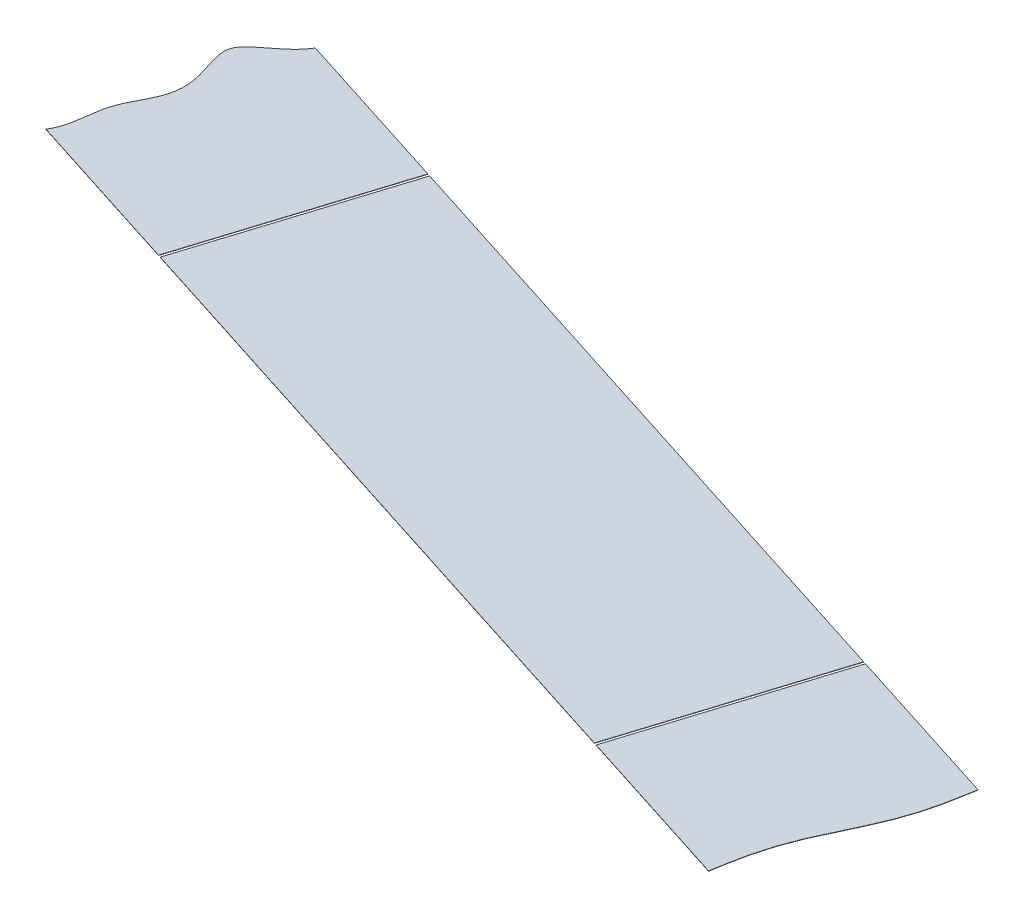
ISO-10303-21;
HEADER;
FILE_DESCRIPTION(('STEP AP214'),'2;1');
FILE_NAME('part.step','',(''),(''),'','','');
FILE_SCHEMA(('AUTOMOTIVE_DESIGN { 1 0 10303 214 1 1 1 1 }'));
ENDSEC;
DATA;
#1=APPLICATION_CONTEXT('core data for automotive mechanical design processes');
#2=APPLICATION_PROTOCOL_DEFINITION('international standard','automotive_design',2000,#1);
#3=PRODUCT_CONTEXT('',#1,'mechanical');
#4=PRODUCT('Part','Part','',(#3));
#5=PRODUCT_RELATED_PRODUCT_CATEGORY('part','',(#4));
#6=PRODUCT_DEFINITION_FORMATION('','',#4);
#7=PRODUCT_DEFINITION_CONTEXT('part definition',#1,'design');
#8=PRODUCT_DEFINITION('design','',#6,#7);
#9=PRODUCT_DEFINITION_SHAPE('','',#8);
#10=(LENGTH_UNIT() NAMED_UNIT(*) SI_UNIT(.MILLI.,.METRE.));
#11=(NAMED_UNIT(*) PLANE_ANGLE_UNIT() SI_UNIT($,.RADIAN.));
#12=(NAMED_UNIT(*) SI_UNIT($,.STERADIAN.) SOLID_ANGLE_UNIT());
#13=UNCERTAINTY_MEASURE_WITH_UNIT(LENGTH_MEASURE(1.E-05),#10,'distance_accuracy_value','');
#14=(GEOMETRIC_REPRESENTATION_CONTEXT(3) GLOBAL_UNCERTAINTY_ASSIGNED_CONTEXT((#13)) GLOBAL_UNIT_ASSIGNED_CONTEXT((#10,
#11,#12)) REPRESENTATION_CONTEXT('',''));
#15=CARTESIAN_POINT('',(0.,0.,0.));
#16=DIRECTION('',(0.,0.,1.));
#17=DIRECTION('',(1.,0.,0.));
#18=AXIS2_PLACEMENT_3D('',#15,#16,#17);
#19=CARTESIAN_POINT('',(719.398655825962,60.3000999940948,202.444842964867));
#20=DIRECTION('',(-0.304317580977551,-0.00396825396825266,0.952562366917996));
#21=DIRECTION('',(0.952569867025211,0.,0.304319977056342));
#22=AXIS2_PLACEMENT_3D('',#19,#20,#21);
#23=PLANE('',#22);
#24=DIRECTION('',(-0.00120761895654779,0.999992126449226,0.00378003915478373));
#25=VECTOR('',#24,1.);
#26=CARTESIAN_POINT('',(1017.8293076594,50.4001779422475,297.744018959244));
#27=LINE('',#26,#25);
#28=CARTESIAN_POINT('',(1017.81735223173,60.3000999940948,297.781441346876));
#29=VERTEX_POINT('',#28);
#30=CARTESIAN_POINT('',(1017.81723146984,60.4000992067398,297.781819350792));
#31=VERTEX_POINT('',#30);
#32=EDGE_CURVE('E67',#29,#31,#27,.T.);
#33=ORIENTED_EDGE('',*,*,#32,.T.);
#34=DIRECTION('',(0.952569867025211,0.,0.304319977056342));
#35=VECTOR('',#34,1.);
#36=CARTESIAN_POINT('',(719.398535064066,60.4000992067397,202.445220968783));
#37=LINE('',#36,#35);
#38=CARTESIAN_POINT('',(781.579904447588,60.4000992067397,222.310465040821));
#39=VERTEX_POINT('',#38);
#40=EDGE_CURVE('E102',#39,#31,#37,.T.);
#41=ORIENTED_EDGE('',*,*,#40,.F.);
#42=DIRECTION('',(-0.00120761895654779,0.999992126449226,0.00378003915478373));
#43=VECTOR('',#42,1.);
#44=CARTESIAN_POINT('',(781.59198063715,50.4001779422475,222.272664649272));
#45=LINE('',#44,#43);
#46=CARTESIAN_POINT('',(781.58002520948,60.3000999940948,222.310087036904));
#47=VERTEX_POINT('',#46);
#48=EDGE_CURVE('E117',#47,#39,#45,.T.);
#49=ORIENTED_EDGE('',*,*,#48,.F.);
#50=DIRECTION('',(0.952569867025211,0.,0.304319977056342));
#51=VECTOR('',#50,1.);
#52=CARTESIAN_POINT('',(719.398655825962,60.3000999940948,202.444842964867));
#53=LINE('',#52,#51);
#54=EDGE_CURVE('E55',#47,#29,#53,.T.);
#55=ORIENTED_EDGE('',*,*,#54,.T.);
#56=EDGE_LOOP('',(#33,#41,#49,#55));
#57=FACE_BOUND('',#56,.T.);
#58=ADVANCED_FACE('F52',(#57),#23,.T.);
#59=CARTESIAN_POINT('',(743.532605919061,60.6151075220523,126.821173368969));
#60=DIRECTION('',(-0.304317580977552,-0.00396825396825266,0.952562366917996));
#61=DIRECTION('',(0.95256986702521,0.,0.304319977056343));
#62=AXIS2_PLACEMENT_3D('',#59,#60,#61);
#63=PLANE('',#62);
#64=DIRECTION('',(0.95256986702521,0.,0.304319977056343));
#65=VECTOR('',#64,1.);
#66=CARTESIAN_POINT('',(743.532485157165,60.7151067346972,126.821551372884));
#67=LINE('',#66,#65);
#68=CARTESIAN_POINT('',(805.737211330316,60.7151067346972,146.694257299354));
#69=VERTEX_POINT('',#68);
#70=CARTESIAN_POINT('',(1041.97453835257,60.7151067346972,222.165611609327));
#71=VERTEX_POINT('',#70);
#72=EDGE_CURVE('E100',#69,#71,#67,.T.);
#73=ORIENTED_EDGE('',*,*,#72,.T.);
#74=DIRECTION('',(-0.00120761895654779,0.999992126449226,0.00378003915478373));
#75=VECTOR('',#74,1.);
#76=CARTESIAN_POINT('',(1041.98661454213,50.715185470205,222.127811217778));
#77=LINE('',#76,#75);
#78=CARTESIAN_POINT('',(1041.97465911446,60.6151075220523,222.16523360541));
#79=VERTEX_POINT('',#78);
#80=EDGE_CURVE('E61',#79,#71,#77,.T.);
#81=ORIENTED_EDGE('',*,*,#80,.F.);
#82=DIRECTION('',(0.95256986702521,0.,0.304319977056343));
#83=VECTOR('',#82,1.);
#84=CARTESIAN_POINT('',(743.532605919061,60.6151075220523,126.821173368969));
#85=LINE('',#84,#83);
#86=CARTESIAN_POINT('',(805.737332092211,60.6151075220523,146.693879295439));
#87=VERTEX_POINT('',#86);
#88=EDGE_CURVE('E106',#87,#79,#85,.T.);
#89=ORIENTED_EDGE('',*,*,#88,.F.);
#90=DIRECTION('',(-0.00120761895654779,0.999992126449226,0.00378003915478373));
#91=VECTOR('',#90,1.);
#92=CARTESIAN_POINT('',(805.749287519881,50.715185470205,146.656456907806));
#93=LINE('',#92,#91);
#94=EDGE_CURVE('E105',#87,#69,#93,.T.);
#95=ORIENTED_EDGE('',*,*,#94,.T.);
#96=EDGE_LOOP('',(#73,#81,#89,#95));
#97=FACE_BOUND('',#96,.T.);
#98=ADVANCED_FACE('F104',(#97),#63,.F.);
#99=CARTESIAN_POINT('',(3534.06709107453,45.2776657130148,5075.77080750446));
#100=DIRECTION('',(0.00120761895654779,-0.999992126449226,-0.00378003915478373));
#101=DIRECTION('',(0.,0.0037800419110846,-0.999992855616054));
#102=AXIS2_PLACEMENT_3D('',#99,#100,#101);
#103=PLANE('',#102);
#104=DIRECTION('',(0.304317580977543,0.00396825396817186,-0.952562366917999));
#105=VECTOR('',#104,1.);
#106=CARTESIAN_POINT('',(-134.223544716836,45.2776657130147,3903.85244144675));
#107=LINE('',#106,#105);
#108=EDGE_CURVE('E89',#29,#79,#107,.T.);
#109=ORIENTED_EDGE('',*,*,#108,.F.);
#110=ORIENTED_EDGE('',*,*,#54,.F.);
#111=DIRECTION('',(-0.304317580977547,-0.00396825396817186,0.952562366917998));
#112=VECTOR('',#111,1.);
#113=CARTESIAN_POINT('',(-370.460871739098,45.2776657130147,3828.38108713676));
#114=LINE('',#113,#112);
#115=EDGE_CURVE('E111',#87,#47,#114,.T.);
#116=ORIENTED_EDGE('',*,*,#115,.F.);
#117=ORIENTED_EDGE('',*,*,#88,.T.);
#118=EDGE_LOOP('',(#109,#110,#116,#117));
#119=FACE_BOUND('',#118,.T.);
#120=ADVANCED_FACE('F126',(#119),#103,.T.);
#121=CARTESIAN_POINT('',(3534.06697031264,45.3776649256597,5075.77118550837));
#122=DIRECTION('',(0.00120761895654779,-0.999992126449226,-0.00378003915478373));
#123=DIRECTION('',(0.,0.0037800419110846,-0.999992855616054));
#124=AXIS2_PLACEMENT_3D('',#121,#122,#123);
#125=PLANE('',#124);
#126=ORIENTED_EDGE('',*,*,#40,.T.);
#127=DIRECTION('',(-0.304317580977543,-0.00396825396817186,0.952562366917999));
#128=VECTOR('',#127,1.);
#129=CARTESIAN_POINT('',(1017.81723146984,60.4000992067398,297.781819350792));
#130=LINE('',#129,#128);
#131=EDGE_CURVE('E14',#71,#31,#130,.T.);
#132=ORIENTED_EDGE('',*,*,#131,.F.);
#133=ORIENTED_EDGE('',*,*,#72,.F.);
#134=DIRECTION('',(0.304317580977547,0.00396825396817186,-0.952562366917998));
#135=VECTOR('',#134,1.);
#136=CARTESIAN_POINT('',(781.579904447585,60.4000992067397,222.31046504082));
#137=LINE('',#136,#135);
#138=EDGE_CURVE('E115',#39,#69,#137,.T.);
#139=ORIENTED_EDGE('',*,*,#138,.F.);
#140=EDGE_LOOP('',(#126,#132,#133,#139));
#141=FACE_BOUND('',#140,.T.);
#142=ADVANCED_FACE('F98',(#141),#125,.F.);
#143=CARTESIAN_POINT('',(781.59198063715,50.4001779422475,222.272664649272));
#144=DIRECTION('',(0.952569867025212,0.,0.304319977056338));
#145=DIRECTION('',(0.304319977056338,0.,-0.952569867025212));
#146=AXIS2_PLACEMENT_3D('',#143,#144,#145);
#147=PLANE('',#146);
#148=ORIENTED_EDGE('',*,*,#115,.T.);
#149=ORIENTED_EDGE('',*,*,#48,.T.);
#150=ORIENTED_EDGE('',*,*,#138,.T.);
#151=ORIENTED_EDGE('',*,*,#94,.F.);
#152=EDGE_LOOP('',(#148,#149,#150,#151));
#153=FACE_BOUND('',#152,.T.);
#154=ADVANCED_FACE('F120',(#153),#147,.F.);
#155=CARTESIAN_POINT('',(1017.8293076594,50.4001779422475,297.744018959244));
#156=DIRECTION('',(-0.952569867025213,0.,-0.304319977056334));
#157=DIRECTION('',(-0.304319977056334,0.,0.952569867025213));
#158=AXIS2_PLACEMENT_3D('',#155,#156,#157);
#159=PLANE('',#158);
#160=ORIENTED_EDGE('',*,*,#108,.T.);
#161=ORIENTED_EDGE('',*,*,#80,.T.);
#162=ORIENTED_EDGE('',*,*,#131,.T.);
#163=ORIENTED_EDGE('',*,*,#32,.F.);
#164=EDGE_LOOP('',(#160,#161,#162,#163));
#165=FACE_BOUND('',#164,.T.);
#166=ADVANCED_FACE('F88',(#165),#159,.F.);
#167=CLOSED_SHELL('',(#58,#98,#120,#142,#154,#166));
#168=MANIFOLD_SOLID_BREP('B2',#167);
#169=CARTESIAN_POINT('',(1104.17938528761,60.6151075220523,242.037939531882));
#170=CARTESIAN_POINT('',(1104.11154771936,60.6135241861804,242.435131574222));
#171=CARTESIAN_POINT('',(1104.07390315354,60.6126465257401,242.655286235224));
#172=CARTESIAN_POINT('',(1104.01557961551,60.6112867474837,242.996376601549));
#173=CARTESIAN_POINT('',(1103.8509705991,60.6074604459044,243.956019170203));
#174=CARTESIAN_POINT('',(1103.75536220091,60.6052635368036,244.506657193769));
#175=CARTESIAN_POINT('',(1103.64138769499,60.6026446075666,245.163071252263));
#176=CARTESIAN_POINT('',(1103.42524179593,60.5977695655939,246.383688688955));
#177=CARTESIAN_POINT('',(1103.20268179566,60.5928744512502,247.607567050267));
#178=CARTESIAN_POINT('',(1102.97269854,60.5879701477239,248.831504841225));
#179=CARTESIAN_POINT('',(1102.73406525112,60.5830608878813,250.053990354404));
#180=CARTESIAN_POINT('',(1102.48554017419,60.5781486637371,251.274099904751));
#181=CARTESIAN_POINT('',(1102.22593554525,60.5732345373678,252.491173066748));
#182=CARTESIAN_POINT('',(1101.95415044629,60.568319130116,253.70469375389));
#183=CARTESIAN_POINT('',(1101.66919065167,60.5634028321969,254.914241108638));
#184=CARTESIAN_POINT('',(1101.37018268743,60.558485903564,256.119467310499));
#185=CARTESIAN_POINT('',(1100.89716012042,60.5510733968325,257.929294423356));
#186=CARTESIAN_POINT('',(1100.20882008833,60.5412623165348,260.304865207316));
#187=CARTESIAN_POINT('',(1099.45567525458,60.531449999889,262.660059702731));
#188=CARTESIAN_POINT('',(1098.63794492631,60.5216389714561,264.994280111085));
#189=CARTESIAN_POINT('',(1097.97310344003,60.5142259644113,266.742958689687));
#190=CARTESIAN_POINT('',(1097.51739285545,60.5093090574694,267.898116958927));
#191=CARTESIAN_POINT('',(1097.0477649255,60.5043927894841,269.048659984524));
#192=CARTESIAN_POINT('',(1096.56513878694,60.4994774251692,270.1948113767));
#193=CARTESIAN_POINT('',(1096.07057421074,60.4945633618901,271.336804582004));
#194=CARTESIAN_POINT('',(1095.56527323999,60.4896512330112,272.474856066598));
#195=CARTESIAN_POINT('',(1095.05059341862,60.4847421265142,273.609111708002));
#196=CARTESIAN_POINT('',(1094.52809164489,60.479838089412,274.739527364635));
#197=CARTESIAN_POINT('',(1093.99966284027,60.4749434987449,275.86555048592));
#198=CARTESIAN_POINT('',(1093.46804184452,60.4700697267661,276.98504630051));
#199=CARTESIAN_POINT('',(1093.17993061473,60.4674477433222,277.58663642265));
#200=CARTESIAN_POINT('',(1092.93936448417,60.4652584485421,278.088950088011));
#201=CARTESIAN_POINT('',(1092.51703470664,60.4614319248842,278.966316683573));
#202=CARTESIAN_POINT('',(1092.36597474371,60.4600647543857,279.27973588656));
#203=CARTESIAN_POINT('',(1092.27534198904,60.4592444812573,279.467780721096));
#204=CARTESIAN_POINT('',(1091.91266880014,60.4559633097882,280.219935526965));
#205=CARTESIAN_POINT('',(1091.82200566052,60.4551427617614,280.408043377433));
#206=CARTESIAN_POINT('',(1091.67098789279,60.4537759733199,280.721374989218));
#207=CARTESIAN_POINT('',(1091.24865724423,60.4499494426555,281.598743160035));
#208=CARTESIAN_POINT('',(1091.0080497895,60.4477597728249,282.101142841345));
#209=CARTESIAN_POINT('',(1090.71998094971,60.4451381763814,282.702644126769));
#210=CARTESIAN_POINT('',(1090.18835985953,60.4402644069711,283.822139231689));
#211=CARTESIAN_POINT('',(1089.65993072333,60.4353698178081,284.948161849148));
#212=CARTESIAN_POINT('',(1089.13742838212,60.4304657811338,286.078577211266));
#213=CARTESIAN_POINT('',(1088.62274784452,60.4255566746672,287.212832615815));
#214=CARTESIAN_POINT('',(1088.11744613526,60.4206445466291,288.350883642063));
#215=CARTESIAN_POINT('',(1087.62288061169,60.4157304830769,289.492876616953));
#216=CARTESIAN_POINT('',(1087.14025347876,60.4108151188606,290.639027665351));
#217=CARTESIAN_POINT('',(1086.67062455728,60.4058988518256,291.789570122808));
#218=CARTESIAN_POINT('',(1086.2149128123,60.4009819447856,292.944728047291));
#219=CARTESIAN_POINT('',(1085.55006933554,60.3935689357572,294.693406514722));
#220=CARTESIAN_POINT('',(1084.73233650805,60.3837579078477,297.02762598619));
#221=CARTESIAN_POINT('',(1084.35195987085,60.3788022035299,298.217115056814));
#222=CARTESIAN_POINT('',(1083.97236511369,60.3738523494265,299.405306269121));
#223=CARTESIAN_POINT('',(1083.28545563557,60.364053633696,301.778063086));
#224=CARTESIAN_POINT('',(1082.81336441087,60.3566503406514,303.585750298328));
#225=CARTESIAN_POINT('',(1082.51493407597,60.3517396338226,304.789515087033));
#226=CARTESIAN_POINT('',(1082.23050559307,60.3468295567687,305.9975864798));
#227=CARTESIAN_POINT('',(1081.95920723674,60.341920369914,307.209617090162));
#228=CARTESIAN_POINT('',(1081.70004722777,60.3370124631633,308.42518692432));
#229=CARTESIAN_POINT('',(1081.45192773402,60.3321064563108,309.643781291205));
#230=CARTESIAN_POINT('',(1081.21366473964,60.3272034101324,310.864741306815));
#231=CARTESIAN_POINT('',(1080.98402073264,60.3223053135912,312.087145448792));
#232=CARTESIAN_POINT('',(1080.76177351098,60.3174163925558,313.309485322835));
#233=CARTESIAN_POINT('',(1080.54591863107,60.3125475164368,314.528564583679));
#234=CARTESIAN_POINT('',(1080.43207564678,60.309931512138,315.184246880645));
#235=CARTESIAN_POINT('',(1080.33660816354,60.3077377595052,315.734094893506));
#236=CARTESIAN_POINT('',(1080.17220879469,60.303916295529,316.692524672941));
#237=CARTESIAN_POINT('',(1080.11394356515,60.3025578736056,317.033274855502));
#238=CARTESIAN_POINT('',(1080.07635508698,60.3016815188188,317.253102030309));
#239=CARTESIAN_POINT('',(1080.00859511661,60.3000999940948,317.649839732116));
#240=B_SPLINE_CURVE_WITH_KNOTS('',2,(#169,#170,#171,#172,#173,#174,#175,#176,#177,#178,#179,
#180,#181,#182,#183,#184,#185,#186,#187,#188,#189,#190,#191,#192,#193,#194,#195,#196,#197,#198,
#199,#200,#201,#202,#203,#204,#205,#206,#207,#208,#209,#210,#211,#212,#213,#214,#215,#216,#217,
#218,#219,#220,#221,#222,#223,#224,#225,#226,#227,#228,#229,#230,#231,#232,#233,#234,#235,#236,
#237,#238,#239),.UNSPECIFIED.,.F.,.F.,(3,2,1,2,1,1,1,1,1,1,1,1,1,1,1,1,1,1,1,1,1,1,1,1,1,1,1,2,
1,2,1,2,1,2,1,1,1,1,1,1,1,1,1,1,1,1,1,1,1,1,1,1,1,1,1,1,1,1,2,1,2,3),(0.,0.0078125,0.015625,
0.03125,0.046875,0.0625,0.078125,0.09375,0.109375,0.125,0.140625,0.15625,0.171875,0.1875,
0.21875,0.25,0.28125,0.3125,0.328125,0.34375,0.359375,0.375,0.390625,0.40625,0.421875,0.4375,
0.453125,0.46875,0.484375,0.4921875,0.5,0.5078125,0.515625,0.53125,0.546875,0.5625,0.578125,
0.59375,0.609375,0.625,0.640625,0.65625,0.671875,0.6875,0.71875,0.75,0.750316619873047,
0.781527042388916,0.812737464904785,0.82834267616272,0.843947887420654,0.859553098678589,
0.875158309936523,0.890763521194458,0.906368732452393,0.921973943710327,0.937579154968262,
0.953184366226196,0.968789577484131,0.984394788742065,0.992197394371033,1.),.UNSPECIFIED.);
#241=DIRECTION('',(-0.00120761895657293,0.999992126449225,0.00378003915486053));
#242=VECTOR('',#241,1.);
#243=SURFACE_OF_LINEAR_EXTRUSION('',#240,#242);
#244=CARTESIAN_POINT('',(1104.17926452572,60.7151067346972,242.038317535797));
#245=CARTESIAN_POINT('',(1104.11142695746,60.7135233988253,242.435509578137));
#246=CARTESIAN_POINT('',(1104.07378239165,60.7126457383851,242.655664239139));
#247=CARTESIAN_POINT('',(1104.01545885362,60.7112859601286,242.996754605464));
#248=CARTESIAN_POINT('',(1103.8508498372,60.7074596585493,243.956397174118));
#249=CARTESIAN_POINT('',(1103.75524143902,60.7052627494486,244.507035197684));
#250=CARTESIAN_POINT('',(1103.6412669331,60.7026438202115,245.163449256178));
#251=CARTESIAN_POINT('',(1103.42512103403,60.6977687782388,246.384066692871));
#252=CARTESIAN_POINT('',(1103.20256103377,60.6928736638951,247.607945054182));
#253=CARTESIAN_POINT('',(1102.97257777811,60.6879693603688,248.83188284514));
#254=CARTESIAN_POINT('',(1102.73394448922,60.6830601005262,250.054368358319));
#255=CARTESIAN_POINT('',(1102.4854194123,60.678147876382,251.274477908666));
#256=CARTESIAN_POINT('',(1102.22581478336,60.6732337500127,252.491551070663));
#257=CARTESIAN_POINT('',(1101.95402968439,60.6683183427609,253.705071757805));
#258=CARTESIAN_POINT('',(1101.66906988978,60.6634020448418,254.914619112554));
#259=CARTESIAN_POINT('',(1101.37006192553,60.6584851162089,256.119845314414));
#260=CARTESIAN_POINT('',(1100.89703935853,60.6510726094774,257.929672427271));
#261=CARTESIAN_POINT('',(1100.20869932644,60.6412615291797,260.305243211231));
#262=CARTESIAN_POINT('',(1099.45555449268,60.6314492125339,262.660437706646));
#263=CARTESIAN_POINT('',(1098.63782416441,60.621638184101,264.994658115));
#264=CARTESIAN_POINT('',(1097.97298267814,60.6142251770562,266.743336693602));
#265=CARTESIAN_POINT('',(1097.51727209355,60.6093082701143,267.898494962843));
#266=CARTESIAN_POINT('',(1097.0476441636,60.6043920021291,269.04903798844));
#267=CARTESIAN_POINT('',(1096.56501802504,60.5994766378141,270.195189380616));
#268=CARTESIAN_POINT('',(1096.07045344885,60.594562574535,271.337182585919));
#269=CARTESIAN_POINT('',(1095.56515247809,60.5896504456561,272.475234070513));
#270=CARTESIAN_POINT('',(1095.05047265672,60.5847413391591,273.609489711918));
#271=CARTESIAN_POINT('',(1094.527970883,60.5798373020569,274.739905368551));
#272=CARTESIAN_POINT('',(1093.99954207838,60.5749427113898,275.865928489835));
#273=CARTESIAN_POINT('',(1093.46792108262,60.570068939411,276.985424304425));
#274=CARTESIAN_POINT('',(1093.17980985283,60.5674469559672,277.587014426565));
#275=CARTESIAN_POINT('',(1092.93924372228,60.565257661187,278.089328091926));
#276=CARTESIAN_POINT('',(1092.51691394475,60.5614311375291,278.966694687489));
#277=CARTESIAN_POINT('',(1092.36585398182,60.5600639670307,279.280113890476));
#278=CARTESIAN_POINT('',(1092.27522122715,60.5592436939022,279.468158725011));
#279=CARTESIAN_POINT('',(1091.91254803825,60.5559625224331,280.220313530881));
#280=CARTESIAN_POINT('',(1091.82188489862,60.5551419744063,280.408421381349));
#281=CARTESIAN_POINT('',(1091.6708671309,60.5537751859648,280.721752993133));
#282=CARTESIAN_POINT('',(1091.24853648233,60.5499486553004,281.59912116395));
#283=CARTESIAN_POINT('',(1091.0079290276,60.5477589854698,282.10152084526));
#284=CARTESIAN_POINT('',(1090.71986018782,60.5451373890263,282.703022130684));
#285=CARTESIAN_POINT('',(1090.18823909764,60.540263619616,283.822517235604));
#286=CARTESIAN_POINT('',(1089.65980996144,60.535369030453,284.948539853064));
#287=CARTESIAN_POINT('',(1089.13730762023,60.5304649937788,286.078955215181));
#288=CARTESIAN_POINT('',(1088.62262708262,60.5255558873122,287.21321061973));
#289=CARTESIAN_POINT('',(1088.11732537337,60.520643759274,288.351261645979));
#290=CARTESIAN_POINT('',(1087.6227598498,60.5157296957218,289.493254620869));
#291=CARTESIAN_POINT('',(1087.14013271686,60.5108143315055,290.639405669267));
#292=CARTESIAN_POINT('',(1086.67050379538,60.5058980644705,291.789948126724));
#293=CARTESIAN_POINT('',(1086.2147920504,60.5009811574305,292.945106051207));
#294=CARTESIAN_POINT('',(1085.54994857365,60.4935681484021,294.693784518637));
#295=CARTESIAN_POINT('',(1084.73221574616,60.4837571204926,297.028003990106));
#296=CARTESIAN_POINT('',(1084.35183910896,60.4788014161748,298.21749306073));
#297=CARTESIAN_POINT('',(1083.97224435179,60.4738515620714,299.405684273036));
#298=CARTESIAN_POINT('',(1083.28533487367,60.4640528463409,301.778441089916));
#299=CARTESIAN_POINT('',(1082.81324364898,60.4566495532964,303.586128302243));
#300=CARTESIAN_POINT('',(1082.51481331407,60.4517388464676,304.789893090949));
#301=CARTESIAN_POINT('',(1082.23038483117,60.4468287694136,305.997964483715));
#302=CARTESIAN_POINT('',(1081.95908647484,60.441919582559,307.209995094078));
#303=CARTESIAN_POINT('',(1081.69992646588,60.4370116758082,308.425564928235));
#304=CARTESIAN_POINT('',(1081.45180697212,60.4321056689557,309.64415929512));
#305=CARTESIAN_POINT('',(1081.21354397775,60.4272026227773,310.865119310731));
#306=CARTESIAN_POINT('',(1080.98389997074,60.4223045262361,312.087523452708));
#307=CARTESIAN_POINT('',(1080.76165274908,60.4174156052007,313.309863326751));
#308=CARTESIAN_POINT('',(1080.54579786917,60.4125467290817,314.528942587595));
#309=CARTESIAN_POINT('',(1080.43195488488,60.409930724783,315.184624884561));
#310=CARTESIAN_POINT('',(1080.33648740165,60.4077369721501,315.734472897421));
#311=CARTESIAN_POINT('',(1080.1720880328,60.4039155081739,316.692902676856));
#312=CARTESIAN_POINT('',(1080.11382280326,60.4025570862505,317.033652859417));
#313=CARTESIAN_POINT('',(1080.07623432509,60.4016807314637,317.253480034224));
#314=CARTESIAN_POINT('',(1080.00847435472,60.4000992067397,317.650217736032));
#315=B_SPLINE_CURVE_WITH_KNOTS('',2,(#244,#245,#246,#247,#248,#249,#250,#251,#252,#253,#254,
#255,#256,#257,#258,#259,#260,#261,#262,#263,#264,#265,#266,#267,#268,#269,#270,#271,#272,#273,
#274,#275,#276,#277,#278,#279,#280,#281,#282,#283,#284,#285,#286,#287,#288,#289,#290,#291,#292,
#293,#294,#295,#296,#297,#298,#299,#300,#301,#302,#303,#304,#305,#306,#307,#308,#309,#310,#311,
#312,#313,#314),.UNSPECIFIED.,.F.,.F.,(3,2,1,2,1,1,1,1,1,1,1,1,1,1,1,1,1,1,1,1,1,1,1,1,1,1,1,2,
1,2,1,2,1,2,1,1,1,1,1,1,1,1,1,1,1,1,1,1,1,1,1,1,1,1,1,1,1,1,2,1,2,3),(0.,0.0078125,0.015625,
0.03125,0.046875,0.0625,0.078125,0.09375,0.109375,0.125,0.140625,0.15625,0.171875,0.1875,
0.21875,0.25,0.28125,0.3125,0.328125,0.34375,0.359375,0.375,0.390625,0.40625,0.421875,0.4375,
0.453125,0.46875,0.484375,0.4921875,0.5,0.5078125,0.515625,0.53125,0.546875,0.5625,0.578125,
0.59375,0.609375,0.625,0.640625,0.65625,0.671875,0.6875,0.71875,0.75,0.750316619873047,
0.781527042388916,0.812737464904785,0.82834267616272,0.843947887420654,0.859553098678589,
0.875158309936523,0.890763521194458,0.906368732452393,0.921973943710327,0.937579154968262,
0.953184366226196,0.968789577484131,0.984394788742065,0.992197394371033,1.),.UNSPECIFIED.);
#316=CARTESIAN_POINT('',(1104.17926452572,60.7151067346972,242.038317535798));
#317=VERTEX_POINT('',#316);
#318=CARTESIAN_POINT('',(1080.00847435472,60.4000992067397,317.650217736032));
#319=VERTEX_POINT('',#318);
#320=EDGE_CURVE('E194',#317,#319,#315,.T.);
#321=ORIENTED_EDGE('',*,*,#320,.T.);
#322=DIRECTION('',(-0.00120761895657293,0.999992126449225,0.00378003915486053));
#323=VECTOR('',#322,1.);
#324=CARTESIAN_POINT('',(1080.00859511661,60.3000999940948,317.649839732116));
#325=LINE('',#324,#323);
#326=CARTESIAN_POINT('',(1080.00859511661,60.3000999940948,317.649839732116));
#327=VERTEX_POINT('',#326);
#328=EDGE_CURVE('E246',#327,#319,#325,.T.);
#329=ORIENTED_EDGE('',*,*,#328,.F.);
#330=CARTESIAN_POINT('',(1104.17938528761,60.6151075220523,242.037939531883));
#331=VERTEX_POINT('',#330);
#332=EDGE_CURVE('E247',#331,#327,#240,.T.);
#333=ORIENTED_EDGE('',*,*,#332,.F.);
#334=DIRECTION('',(-0.00120761895657293,0.999992126449225,0.00378003915486053));
#335=VECTOR('',#334,1.);
#336=CARTESIAN_POINT('',(1104.17938528761,60.6151075220523,242.037939531883));
#337=LINE('',#336,#335);
#338=EDGE_CURVE('E50',#331,#317,#337,.T.);
#339=ORIENTED_EDGE('',*,*,#338,.T.);
#340=EDGE_LOOP('',(#321,#329,#333,#339));
#341=FACE_BOUND('',#340,.T.);
#342=ADVANCED_FACE('F185',(#341),#243,.F.);
#343=CARTESIAN_POINT('',(3534.06697031264,45.3776649256597,5075.77118550837));
#344=DIRECTION('',(0.00120761895654779,-0.999992126449226,-0.00378003915478373));
#345=DIRECTION('',(0.,0.0037800419110846,-0.999992855616054));
#346=AXIS2_PLACEMENT_3D('',#343,#344,#345);
#347=PLANE('',#346);
#348=DIRECTION('',(0.95256986702521,0.,0.304319977056343));
#349=VECTOR('',#348,1.);
#350=CARTESIAN_POINT('',(743.532485157165,60.7151067346972,126.821551372884));
#351=LINE('',#350,#349);
#352=CARTESIAN_POINT('',(1042.92710821959,60.7151067346973,222.469931586382));
#353=VERTEX_POINT('',#352);
#354=EDGE_CURVE('E241',#353,#317,#351,.T.);
#355=ORIENTED_EDGE('',*,*,#354,.F.);
#356=DIRECTION('',(0.304317580977548,0.00396825396817186,-0.952562366917997));
#357=VECTOR('',#356,1.);
#358=CARTESIAN_POINT('',(1042.92710821959,60.7151067346973,222.469931586382));
#359=LINE('',#358,#357);
#360=CARTESIAN_POINT('',(1018.76980133686,60.4000992067397,298.08613932785));
#361=VERTEX_POINT('',#360);
#362=EDGE_CURVE('E233',#361,#353,#359,.T.);
#363=ORIENTED_EDGE('',*,*,#362,.F.);
#364=DIRECTION('',(0.952569867025211,0.,0.304319977056342));
#365=VECTOR('',#364,1.);
#366=CARTESIAN_POINT('',(719.398535064066,60.4000992067397,202.445220968783));
#367=LINE('',#366,#365);
#368=EDGE_CURVE('E189',#361,#319,#367,.T.);
#369=ORIENTED_EDGE('',*,*,#368,.T.);
#370=ORIENTED_EDGE('',*,*,#320,.F.);
#371=EDGE_LOOP('',(#355,#363,#369,#370));
#372=FACE_BOUND('',#371,.T.);
#373=ADVANCED_FACE('F244',(#372),#347,.F.);
#374=CARTESIAN_POINT('',(3534.06709107453,45.2776657130148,5075.77080750446));
#375=DIRECTION('',(0.00120761895654779,-0.999992126449226,-0.00378003915478373));
#376=DIRECTION('',(0.,0.0037800419110846,-0.999992855616054));
#377=AXIS2_PLACEMENT_3D('',#374,#375,#376);
#378=PLANE('',#377);
#379=DIRECTION('',(-0.304317580977548,-0.00396825396817186,0.952562366917998));
#380=VECTOR('',#379,1.);
#381=CARTESIAN_POINT('',(-133.270974849824,45.2776657130148,3904.15676142378));
#382=LINE('',#381,#380);
#383=CARTESIAN_POINT('',(1042.92722898149,60.6151075220523,222.469553582466));
#384=VERTEX_POINT('',#383);
#385=CARTESIAN_POINT('',(1018.76992209876,60.3000999940948,298.085761323932));
#386=VERTEX_POINT('',#385);
#387=EDGE_CURVE('E231',#384,#386,#382,.T.);
#388=ORIENTED_EDGE('',*,*,#387,.F.);
#389=DIRECTION('',(0.95256986702521,0.,0.304319977056343));
#390=VECTOR('',#389,1.);
#391=CARTESIAN_POINT('',(743.532605919061,60.6151075220523,126.821173368969));
#392=LINE('',#391,#390);
#393=EDGE_CURVE('E242',#384,#331,#392,.T.);
#394=ORIENTED_EDGE('',*,*,#393,.T.);
#395=ORIENTED_EDGE('',*,*,#332,.T.);
#396=DIRECTION('',(0.952569867025211,0.,0.304319977056342));
#397=VECTOR('',#396,1.);
#398=CARTESIAN_POINT('',(719.398655825962,60.3000999940948,202.444842964867));
#399=LINE('',#398,#397);
#400=EDGE_CURVE('E223',#386,#327,#399,.T.);
#401=ORIENTED_EDGE('',*,*,#400,.F.);
#402=EDGE_LOOP('',(#388,#394,#395,#401));
#403=FACE_BOUND('',#402,.T.);
#404=ADVANCED_FACE('F266',(#403),#378,.T.);
#405=CARTESIAN_POINT('',(743.532605919061,60.6151075220523,126.821173368969));
#406=DIRECTION('',(-0.304317580977552,-0.00396825396825266,0.952562366917996));
#407=DIRECTION('',(0.95256986702521,0.,0.304319977056343));
#408=AXIS2_PLACEMENT_3D('',#405,#406,#407);
#409=PLANE('',#408);
#410=ORIENTED_EDGE('',*,*,#393,.F.);
#411=DIRECTION('',(-0.00120761895654779,0.999992126449226,0.00378003915478373));
#412=VECTOR('',#411,1.);
#413=CARTESIAN_POINT('',(1042.93918440916,50.715185470205,222.432131194834));
#414=LINE('',#413,#412);
#415=EDGE_CURVE('E228',#384,#353,#414,.T.);
#416=ORIENTED_EDGE('',*,*,#415,.T.);
#417=ORIENTED_EDGE('',*,*,#354,.T.);
#418=ORIENTED_EDGE('',*,*,#338,.F.);
#419=EDGE_LOOP('',(#410,#416,#417,#418));
#420=FACE_BOUND('',#419,.T.);
#421=ADVANCED_FACE('F239',(#420),#409,.F.);
#422=CARTESIAN_POINT('',(719.398655825962,60.3000999940948,202.444842964867));
#423=DIRECTION('',(-0.304317580977551,-0.00396825396825266,0.952562366917996));
#424=DIRECTION('',(0.952569867025211,0.,0.304319977056342));
#425=AXIS2_PLACEMENT_3D('',#422,#423,#424);
#426=PLANE('',#425);
#427=DIRECTION('',(-0.00120761895654779,0.999992126449226,0.00378003915478373));
#428=VECTOR('',#427,1.);
#429=CARTESIAN_POINT('',(1018.78187752643,50.4001779422475,298.0483389363));
#430=LINE('',#429,#428);
#431=EDGE_CURVE('E202',#386,#361,#430,.T.);
#432=ORIENTED_EDGE('',*,*,#431,.F.);
#433=ORIENTED_EDGE('',*,*,#400,.T.);
#434=ORIENTED_EDGE('',*,*,#328,.T.);
#435=ORIENTED_EDGE('',*,*,#368,.F.);
#436=EDGE_LOOP('',(#432,#433,#434,#435));
#437=FACE_BOUND('',#436,.T.);
#438=ADVANCED_FACE('F187',(#437),#426,.T.);
#439=CARTESIAN_POINT('',(1042.93918440916,50.715185470205,222.432131194834));
#440=DIRECTION('',(0.952569867025212,0.,0.304319977056339));
#441=DIRECTION('',(0.304319977056339,0.,-0.952569867025212));
#442=AXIS2_PLACEMENT_3D('',#439,#440,#441);
#443=PLANE('',#442);
#444=ORIENTED_EDGE('',*,*,#387,.T.);
#445=ORIENTED_EDGE('',*,*,#431,.T.);
#446=ORIENTED_EDGE('',*,*,#362,.T.);
#447=ORIENTED_EDGE('',*,*,#415,.F.);
#448=EDGE_LOOP('',(#444,#445,#446,#447));
#449=FACE_BOUND('',#448,.T.);
#450=ADVANCED_FACE('F234',(#449),#443,.F.);
#451=CLOSED_SHELL('',(#342,#373,#404,#421,#438,#450));
#452=MANIFOLD_SOLID_BREP('B8',#451);
#453=CARTESIAN_POINT('',(719.398655825961,60.3000999940948,202.444842964866));
#454=CARTESIAN_POINT('',(720.086938593391,60.3052122522405,201.312305866357));
#455=CARTESIAN_POINT('',(720.872120623064,60.3130304882867,199.494871309643));
#456=CARTESIAN_POINT('',(721.209232543418,60.3170100399614,198.549797079023));
#457=CARTESIAN_POINT('',(721.413047876414,60.3196494090865,197.916677424384));
#458=CARTESIAN_POINT('',(721.682367393787,60.3234827023809,196.988637365931));
#459=CARTESIAN_POINT('',(721.915577629332,60.327498652648,196.000740311669));
#460=CARTESIAN_POINT('',(722.054554720819,60.3301454920289,195.344930392982));
#461=CARTESIAN_POINT('',(722.180332329845,60.3327799842052,194.688169997964));
#462=CARTESIAN_POINT('',(722.292821293786,60.3353603678096,194.04147842091));
#463=CARTESIAN_POINT('',(722.39765003574,60.337964427728,193.386076151831));
#464=CARTESIAN_POINT('',(722.491927217757,60.3404810800053,192.750426241393));
#465=CARTESIAN_POINT('',(722.561961739956,60.3424506281811,192.251765361271));
#466=CARTESIAN_POINT('',(722.609412732941,60.34381370465,191.906328987584));
#467=CARTESIAN_POINT('',(722.657686726547,60.3452253153285,191.548316036176));
#468=CARTESIAN_POINT('',(722.690757894747,60.3462026097151,191.300342593604));
#469=CARTESIAN_POINT('',(722.712679558363,60.3468538590329,191.135060926398));
#470=CARTESIAN_POINT('',(722.737639688308,60.3475979052103,190.946200979763));
#471=CARTESIAN_POINT('',(722.796938902645,60.3493570275705,190.49977765312));
#472=CARTESIAN_POINT('',(722.864759753156,60.3513563715698,189.992527216252));
#473=CARTESIAN_POINT('',(722.928797388112,60.3531914359687,189.527527565046));
#474=CARTESIAN_POINT('',(722.970831227785,60.3543731634578,189.228335605194));
#475=CARTESIAN_POINT('',(723.043974763686,60.356375813902,188.721910915568));
#476=CARTESIAN_POINT('',(723.144406926635,60.358958728818,188.070697873944));
#477=CARTESIAN_POINT('',(723.252643830854,60.3615427703849,187.421680182971));
#478=CARTESIAN_POINT('',(723.371059264864,60.3641443694408,186.771269499754));
#479=CARTESIAN_POINT('',(723.500005802495,60.3667388065703,186.126117870643));
#480=CARTESIAN_POINT('',(723.641755960772,60.3693481587295,185.481110944469));
#481=CARTESIAN_POINT('',(723.798397240745,60.3719816542359,184.834474311272));
#482=CARTESIAN_POINT('',(724.063090285931,60.3760598710301,183.840162826315));
#483=CARTESIAN_POINT('',(724.461016995183,60.3812487832134,182.594586445253));
#484=CARTESIAN_POINT('',(724.907098109876,60.3863425650999,181.389560363906));
#485=CARTESIAN_POINT('',(725.417755262418,60.391545763946,180.176218799701));
#486=CARTESIAN_POINT('',(725.973102520453,60.396725760412,178.983292583841));
#487=CARTESIAN_POINT('',(726.288643383492,60.3994918904975,178.35233214116));
#488=CARTESIAN_POINT('',(726.552822294542,60.4018077656167,177.824075860636));
#489=CARTESIAN_POINT('',(726.892516977714,60.4046788299914,177.173072013957));
#490=CARTESIAN_POINT('',(727.094304690212,60.4063843188945,176.786358345611));
#491=CARTESIAN_POINT('',(727.924256024317,60.4133159865973,175.217763968911));
#492=CARTESIAN_POINT('',(728.132796794922,60.4150802860172,174.817649663496));
#493=CARTESIAN_POINT('',(728.471387191622,60.4179448330253,174.168017167158));
#494=CARTESIAN_POINT('',(728.73438366897,60.4202563390625,173.640538952187));
#495=CARTESIAN_POINT('',(729.050001826531,60.4230303430492,173.007520198316));
#496=CARTESIAN_POINT('',(729.602494792361,60.4282167959623,171.81197409064));
#497=CARTESIAN_POINT('',(730.105673282004,60.4334233234934,170.595362710094));
#498=CARTESIAN_POINT('',(730.781509223776,60.4414175649077,168.696433656057));
#499=CARTESIAN_POINT('',(731.346667271782,60.4517654375638,166.13950363135));
#500=CARTESIAN_POINT('',(731.555187712655,60.4619161077943,163.520806663904));
#501=CARTESIAN_POINT('',(731.418605530389,60.4717159916992,160.884657785707));
#502=CARTESIAN_POINT('',(731.196614876911,60.4766306534627,159.513586488089));
#503=CARTESIAN_POINT('',(730.997215813272,60.4810451589313,158.282046652314));
#504=CARTESIAN_POINT('',(730.50975014291,60.487973918576,156.293342946563));
#505=CARTESIAN_POINT('',(730.160898904768,60.4923353070129,155.028109103829));
#506=CARTESIAN_POINT('',(729.960441196561,60.4946342601899,154.355890774761));
#507=CARTESIAN_POINT('',(729.793225346436,60.4965519784623,153.79514626476));
#508=CARTESIAN_POINT('',(729.574820052275,60.4989344002953,153.095112921204));
#509=CARTESIAN_POINT('',(729.469706702502,60.5000810040917,152.758203278165));
#510=CARTESIAN_POINT('',(729.177268815323,60.5032276099876,151.832357139066));
#511=CARTESIAN_POINT('',(728.921782418416,60.5059766211044,151.023497875137));
#512=CARTESIAN_POINT('',(728.779570735792,60.5075521355306,150.561269979188));
#513=CARTESIAN_POINT('',(728.560387670811,60.5099803894862,149.848863480052));
#514=CARTESIAN_POINT('',(728.401635135722,60.5118988741106,149.290620032443));
#515=CARTESIAN_POINT('',(728.203941153354,60.5142879563718,148.595441399696));
#516=CARTESIAN_POINT('',(728.06292455327,60.5163265553,148.011088405931));
#517=CARTESIAN_POINT('',(727.894161229195,60.5187662732579,147.311756883237));
#518=CARTESIAN_POINT('',(727.790926423102,60.5209263305736,146.707342874899));
#519=CARTESIAN_POINT('',(727.670600990957,60.523443987552,146.002867519162));
#520=CARTESIAN_POINT('',(727.587466841466,60.5283510992083,144.67815441706));
#521=CARTESIAN_POINT('',(727.711013002134,60.5334563924897,143.367041966613));
#522=CARTESIAN_POINT('',(728.089407001019,60.5386571067416,142.112103236245));
#523=CARTESIAN_POINT('',(728.717314028176,60.5437966145796,140.95306896079));
#524=CARTESIAN_POINT('',(729.529472011985,60.5487270974127,139.908194430656));
#525=CARTESIAN_POINT('',(730.454509900635,60.5534224656784,138.961580424812));
#526=CARTESIAN_POINT('',(730.991615066122,60.5558669168883,138.486502387169));
#527=CARTESIAN_POINT('',(731.445162398983,60.5579310830847,138.085332577754));
#528=CARTESIAN_POINT('',(732.008767948681,60.560334926102,137.629463399134));
#529=CARTESIAN_POINT('',(732.46238733536,60.5622696653815,137.262555909804));
#530=CARTESIAN_POINT('',(733.046296511152,60.564674554901,136.812896336114));
#531=CARTESIAN_POINT('',(733.481429178663,60.5664666931908,136.477807288223));
#532=CARTESIAN_POINT('',(734.360104078081,60.5700338677244,135.814840086158));
#533=CARTESIAN_POINT('',(734.93685595742,60.5723756176585,135.379597241797));
#534=CARTESIAN_POINT('',(735.152009505906,60.5732519879151,135.21649315015));
#535=CARTESIAN_POINT('',(735.750871001669,60.5756912895506,134.762506864653));
#536=CARTESIAN_POINT('',(736.20796218318,60.5775841328462,134.407791910224));
#537=CARTESIAN_POINT('',(736.764638012297,60.5798893624231,133.975796611816));
#538=CARTESIAN_POINT('',(737.778138292534,60.5842079566648,133.157117767131));
#539=CARTESIAN_POINT('',(738.254999119128,60.5863224369897,132.750085606976));
#540=CARTESIAN_POINT('',(739.32611652778,60.5910719499713,131.835816268186));
#541=CARTESIAN_POINT('',(740.203946340164,60.5954374212813,130.961393310958));
#542=CARTESIAN_POINT('',(741.185219856917,60.6003173209203,129.983928114105));
#543=CARTESIAN_POINT('',(742.848235502159,60.6100752068069,127.933811826466));
#544=CARTESIAN_POINT('',(743.53260591906,60.6151075220523,126.821173368967));
#545=B_SPLINE_CURVE_WITH_KNOTS('',2,(#453,#454,#455,#456,#457,#458,#459,#460,#461,#462,#463,
#464,#465,#466,#467,#468,#469,#470,#471,#472,#473,#474,#475,#476,#477,#478,#479,#480,#481,#482,
#483,#484,#485,#486,#487,#488,#489,#490,#491,#492,#493,#494,#495,#496,#497,#498,#499,#500,#501,
#502,#503,#504,#505,#506,#507,#508,#509,#510,#511,#512,#513,#514,#515,#516,#517,#518,#519,#520,
#521,#522,#523,#524,#525,#526,#527,#528,#529,#530,#531,#532,#533,#534,#535,#536,#537,#538,#539,
#540,#541,#542,#543,#544),.UNSPECIFIED.,.F.,.F.,(3,1,1,1,1,1,1,1,1,1,1,1,1,1,1,1,1,1,1,1,1,1,1,
1,1,1,1,1,1,1,1,1,1,2,2,1,2,2,1,1,1,1,1,1,2,1,1,2,2,2,2,2,2,2,1,1,1,1,1,1,2,2,2,1,1,2,2,1,2,2,1,
3),(0.,0.03125,0.046875,0.0546875,0.0625,0.078125,0.0859375,0.09375,0.1015625,0.109375,
0.1171875,0.125,0.12890625,0.1328125,0.13671875,0.138671875,0.140625,0.14453125,0.1484375,
0.15625,0.16015625,0.1640625,0.171875,0.1796875,0.1875,0.1953125,0.203125,0.2109375,0.21875,
0.235113143920898,0.25,0.265625,0.28125,0.296875,0.3125,0.328125,0.34375,0.359375,0.375,
0.390625,0.40625,0.4375,0.46875,0.5,0.53125,0.5625,0.578125,0.59375,0.609375,0.625,0.640625,
0.65625,0.671875,0.6875,0.703125,0.71875,0.734375,0.75,0.765625,0.78125,0.796875,0.8125,
0.828125,0.84375,0.8515625,0.859375,0.875,0.890625,0.90625,0.9375,0.96875,1.),.UNSPECIFIED.);
#546=DIRECTION('',(-0.00120761895657293,0.999992126449225,0.00378003915486053));
#547=VECTOR('',#546,1.);
#548=SURFACE_OF_LINEAR_EXTRUSION('',#545,#547);
#549=CARTESIAN_POINT('',(719.398535064066,60.4000992067397,202.445220968781));
#550=CARTESIAN_POINT('',(720.086817831496,60.4052114648854,201.312683870273));
#551=CARTESIAN_POINT('',(720.871999861168,60.4130297009317,199.495249313558));
#552=CARTESIAN_POINT('',(721.209111781523,60.4170092526063,198.550175082938));
#553=CARTESIAN_POINT('',(721.412927114518,60.4196486217315,197.917055428299));
#554=CARTESIAN_POINT('',(721.682246631891,60.4234819150258,196.989015369846));
#555=CARTESIAN_POINT('',(721.915456867436,60.4274978652929,196.001118315585));
#556=CARTESIAN_POINT('',(722.054433958923,60.4301447046738,195.345308396898));
#557=CARTESIAN_POINT('',(722.18021156795,60.4327791968501,194.688548001879));
#558=CARTESIAN_POINT('',(722.292700531891,60.4353595804545,194.041856424825));
#559=CARTESIAN_POINT('',(722.397529273844,60.4379636403729,193.386454155747));
#560=CARTESIAN_POINT('',(722.491806455861,60.4404802926503,192.750804245309));
#561=CARTESIAN_POINT('',(722.561840978061,60.442449840826,192.252143365186));
#562=CARTESIAN_POINT('',(722.609291971045,60.443812917295,191.906706991499));
#563=CARTESIAN_POINT('',(722.657565964651,60.4452245279734,191.548694040091));
#564=CARTESIAN_POINT('',(722.690637132851,60.44620182236,191.300720597519));
#565=CARTESIAN_POINT('',(722.712558796467,60.4468530716778,191.135438930314));
#566=CARTESIAN_POINT('',(722.737518926412,60.4475971178553,190.946578983679));
#567=CARTESIAN_POINT('',(722.796818140749,60.4493562402155,190.500155657036));
#568=CARTESIAN_POINT('',(722.864638991261,60.4513555842148,189.992905220167));
#569=CARTESIAN_POINT('',(722.928676626216,60.4531906486137,189.527905568961));
#570=CARTESIAN_POINT('',(722.970710465889,60.4543723761027,189.228713609109));
#571=CARTESIAN_POINT('',(723.04385400179,60.4563750265469,188.722288919483));
#572=CARTESIAN_POINT('',(723.144286164739,60.4589579414629,188.071075877859));
#573=CARTESIAN_POINT('',(723.252523068958,60.4615419830298,187.422058186887));
#574=CARTESIAN_POINT('',(723.370938502969,60.4641435820858,186.771647503669));
#575=CARTESIAN_POINT('',(723.4998850406,60.4667380192152,186.126495874558));
#576=CARTESIAN_POINT('',(723.641635198876,60.4693473713744,185.481488948384));
#577=CARTESIAN_POINT('',(723.798276478849,60.4719808668808,184.834852315187));
#578=CARTESIAN_POINT('',(724.062969524036,60.4760590836751,183.840540830231));
#579=CARTESIAN_POINT('',(724.460896233287,60.4812479958583,182.594964449168));
#580=CARTESIAN_POINT('',(724.90697734798,60.4863417777448,181.389938367821));
#581=CARTESIAN_POINT('',(725.417634500523,60.491544976591,180.176596803616));
#582=CARTESIAN_POINT('',(725.972981758557,60.4967249730569,178.983670587756));
#583=CARTESIAN_POINT('',(726.288522621596,60.4994911031424,178.352710145075));
#584=CARTESIAN_POINT('',(726.552701532646,60.5018069782616,177.824453864552));
#585=CARTESIAN_POINT('',(726.892396215819,60.5046780426363,177.173450017873));
#586=CARTESIAN_POINT('',(727.094183928316,60.5063835315394,176.786736349526));
#587=CARTESIAN_POINT('',(727.924135262421,60.5133151992422,175.218141972827));
#588=CARTESIAN_POINT('',(728.132676033026,60.5150794986621,174.818027667412));
#589=CARTESIAN_POINT('',(728.471266429727,60.5179440456702,174.168395171074));
#590=CARTESIAN_POINT('',(728.734262907075,60.5202555517074,173.640916956103));
#591=CARTESIAN_POINT('',(729.049881064635,60.5230295556941,173.007898202232));
#592=CARTESIAN_POINT('',(729.602374030465,60.5282160086072,171.812352094555));
#593=CARTESIAN_POINT('',(730.105552520109,60.5334225361383,170.59574071401));
#594=CARTESIAN_POINT('',(730.78138846188,60.5414167775526,168.696811659972));
#595=CARTESIAN_POINT('',(731.346546509886,60.5517646502087,166.139881635266));
#596=CARTESIAN_POINT('',(731.555066950759,60.5619153204392,163.52118466782));
#597=CARTESIAN_POINT('',(731.418484768493,60.5717152043441,160.885035789622));
#598=CARTESIAN_POINT('',(731.196494115015,60.5766298661076,159.513964492004));
#599=CARTESIAN_POINT('',(730.997095051376,60.5810443715762,158.28242465623));
#600=CARTESIAN_POINT('',(730.509629381015,60.587973131221,156.293720950479));
#601=CARTESIAN_POINT('',(730.160778142872,60.5923345196578,155.028487107744));
#602=CARTESIAN_POINT('',(729.960320434665,60.5946334728348,154.356268778677));
#603=CARTESIAN_POINT('',(729.793104584541,60.5965511911072,153.795524268676));
#604=CARTESIAN_POINT('',(729.574699290379,60.5989336129402,153.095490925119));
#605=CARTESIAN_POINT('',(729.469585940606,60.6000802167366,152.75858128208));
#606=CARTESIAN_POINT('',(729.177148053427,60.6032268226325,151.832735142981));
#607=CARTESIAN_POINT('',(728.92166165652,60.6059758337493,151.023875879053));
#608=CARTESIAN_POINT('',(728.779449973897,60.6075513481755,150.561647983104));
#609=CARTESIAN_POINT('',(728.560266908915,60.6099796021311,149.849241483968));
#610=CARTESIAN_POINT('',(728.401514373826,60.6118980867555,149.290998036359));
#611=CARTESIAN_POINT('',(728.203820391459,60.6142871690167,148.595819403611));
#612=CARTESIAN_POINT('',(728.062803791375,60.6163257679449,148.011466409847));
#613=CARTESIAN_POINT('',(727.894040467299,60.6187654859028,147.312134887153));
#614=CARTESIAN_POINT('',(727.790805661206,60.6209255432185,146.707720878814));
#615=CARTESIAN_POINT('',(727.670480229061,60.6234432001969,146.003245523078));
#616=CARTESIAN_POINT('',(727.587346079571,60.6283503118532,144.678532420975));
#617=CARTESIAN_POINT('',(727.710892240239,60.6334556051346,143.367419970528));
#618=CARTESIAN_POINT('',(728.089286239123,60.6386563193865,142.112481240161));
#619=CARTESIAN_POINT('',(728.71719326628,60.6437958272245,140.953446964706));
#620=CARTESIAN_POINT('',(729.529351250089,60.6487263100577,139.908572434571));
#621=CARTESIAN_POINT('',(730.454389138739,60.6534216783233,138.961958428727));
#622=CARTESIAN_POINT('',(730.991494304226,60.6558661295332,138.486880391084));
#623=CARTESIAN_POINT('',(731.445041637087,60.6579302957297,138.085710581669));
#624=CARTESIAN_POINT('',(732.008647186785,60.6603341387469,137.629841403049));
#625=CARTESIAN_POINT('',(732.462266573465,60.6622688780264,137.262933913719));
#626=CARTESIAN_POINT('',(733.046175749256,60.6646737675459,136.81327434003));
#627=CARTESIAN_POINT('',(733.481308416767,60.6664659058357,136.478185292138));
#628=CARTESIAN_POINT('',(734.359983316185,60.6700330803693,135.815218090074));
#629=CARTESIAN_POINT('',(734.936735195524,60.6723748303035,135.379975245712));
#630=CARTESIAN_POINT('',(735.15188874401,60.6732512005601,135.216871154066));
#631=CARTESIAN_POINT('',(735.750750239773,60.6756905021956,134.762884868568));
#632=CARTESIAN_POINT('',(736.207841421284,60.6775833454912,134.40816991414));
#633=CARTESIAN_POINT('',(736.764517250402,60.6798885750681,133.976174615731));
#634=CARTESIAN_POINT('',(737.778017530638,60.6842071693097,133.157495771047));
#635=CARTESIAN_POINT('',(738.254878357232,60.6863216496346,132.750463610891));
#636=CARTESIAN_POINT('',(739.325995765884,60.6910711626162,131.836194272102));
#637=CARTESIAN_POINT('',(740.203825578268,60.6954366339262,130.961771314873));
#638=CARTESIAN_POINT('',(741.185099095021,60.7003165335653,129.98430611802));
#639=CARTESIAN_POINT('',(742.848114740263,60.7100744194518,127.934189830382));
#640=CARTESIAN_POINT('',(743.532485157164,60.7151067346972,126.821551372883));
#641=B_SPLINE_CURVE_WITH_KNOTS('',2,(#549,#550,#551,#552,#553,#554,#555,#556,#557,#558,#559,
#560,#561,#562,#563,#564,#565,#566,#567,#568,#569,#570,#571,#572,#573,#574,#575,#576,#577,#578,
#579,#580,#581,#582,#583,#584,#585,#586,#587,#588,#589,#590,#591,#592,#593,#594,#595,#596,#597,
#598,#599,#600,#601,#602,#603,#604,#605,#606,#607,#608,#609,#610,#611,#612,#613,#614,#615,#616,
#617,#618,#619,#620,#621,#622,#623,#624,#625,#626,#627,#628,#629,#630,#631,#632,#633,#634,#635,
#636,#637,#638,#639,#640),.UNSPECIFIED.,.F.,.F.,(3,1,1,1,1,1,1,1,1,1,1,1,1,1,1,1,1,1,1,1,1,1,1,
1,1,1,1,1,1,1,1,1,1,2,2,1,2,2,1,1,1,1,1,1,2,1,1,2,2,2,2,2,2,2,1,1,1,1,1,1,2,2,2,1,1,2,2,1,2,2,1,
3),(0.,0.03125,0.046875,0.0546875,0.0625,0.078125,0.0859375,0.09375,0.1015625,0.109375,
0.1171875,0.125,0.12890625,0.1328125,0.13671875,0.138671875,0.140625,0.14453125,0.1484375,
0.15625,0.16015625,0.1640625,0.171875,0.1796875,0.1875,0.1953125,0.203125,0.2109375,0.21875,
0.235113143920898,0.25,0.265625,0.28125,0.296875,0.3125,0.328125,0.34375,0.359375,0.375,
0.390625,0.40625,0.4375,0.46875,0.5,0.53125,0.5625,0.578125,0.59375,0.609375,0.625,0.640625,
0.65625,0.671875,0.6875,0.703125,0.71875,0.734375,0.75,0.765625,0.78125,0.796875,0.8125,
0.828125,0.84375,0.8515625,0.859375,0.875,0.890625,0.90625,0.9375,0.96875,1.),.UNSPECIFIED.);
#642=CARTESIAN_POINT('',(719.398535064065,60.4000992067397,202.445220968782));
#643=VERTEX_POINT('',#642);
#644=CARTESIAN_POINT('',(743.532485157164,60.7151067346972,126.821551372884));
#645=VERTEX_POINT('',#644);
#646=EDGE_CURVE('E356',#643,#645,#641,.T.);
#647=ORIENTED_EDGE('',*,*,#646,.T.);
#648=DIRECTION('',(-0.00120761895657293,0.999992126449225,0.00378003915486053));
#649=VECTOR('',#648,1.);
#650=CARTESIAN_POINT('',(743.53260591906,60.6151075220523,126.821173368968));
#651=LINE('',#650,#649);
#652=CARTESIAN_POINT('',(743.53260591906,60.6151075220523,126.821173368968));
#653=VERTEX_POINT('',#652);
#654=EDGE_CURVE('E328',#653,#645,#651,.T.);
#655=ORIENTED_EDGE('',*,*,#654,.F.);
#656=CARTESIAN_POINT('',(719.398655825961,60.3000999940948,202.444842964867));
#657=VERTEX_POINT('',#656);
#658=EDGE_CURVE('E344',#657,#653,#545,.T.);
#659=ORIENTED_EDGE('',*,*,#658,.F.);
#660=DIRECTION('',(-0.00120761895657293,0.999992126449225,0.00378003915486053));
#661=VECTOR('',#660,1.);
#662=CARTESIAN_POINT('',(719.398655825961,60.3000999940948,202.444842964867));
#663=LINE('',#662,#661);
#664=EDGE_CURVE('E183',#657,#643,#663,.T.);
#665=ORIENTED_EDGE('',*,*,#664,.T.);
#666=EDGE_LOOP('',(#647,#655,#659,#665));
#667=FACE_BOUND('',#666,.T.);
#668=ADVANCED_FACE('F320',(#667),#548,.F.);
#669=CARTESIAN_POINT('',(3534.06709107453,45.2776657130148,5075.77080750446));
#670=DIRECTION('',(0.00120761895654779,-0.999992126449226,-0.00378003915478373));
#671=DIRECTION('',(0.,0.0037800419110846,-0.999992855616054));
#672=AXIS2_PLACEMENT_3D('',#669,#670,#671);
#673=PLANE('',#672);
#674=DIRECTION('',(0.304317580977547,0.00396825396817186,-0.952562366917998));
#675=VECTOR('',#674,1.);
#676=CARTESIAN_POINT('',(-371.413441606125,45.2776657130147,3828.07676715971));
#677=LINE('',#676,#675);
#678=CARTESIAN_POINT('',(780.627455342455,60.3000999940948,222.005767059848));
#679=VERTEX_POINT('',#678);
#680=CARTESIAN_POINT('',(804.784762225186,60.6151075220523,146.389559318382));
#681=VERTEX_POINT('',#680);
#682=EDGE_CURVE('E383',#679,#681,#677,.T.);
#683=ORIENTED_EDGE('',*,*,#682,.F.);
#684=DIRECTION('',(0.952569867025211,0.,0.304319977056342));
#685=VECTOR('',#684,1.);
#686=CARTESIAN_POINT('',(719.398655825962,60.3000999940948,202.444842964867));
#687=LINE('',#686,#685);
#688=EDGE_CURVE('E372',#657,#679,#687,.T.);
#689=ORIENTED_EDGE('',*,*,#688,.F.);
#690=ORIENTED_EDGE('',*,*,#658,.T.);
#691=DIRECTION('',(0.95256986702521,0.,0.304319977056343));
#692=VECTOR('',#691,1.);
#693=CARTESIAN_POINT('',(743.532605919061,60.6151075220523,126.821173368969));
#694=LINE('',#693,#692);
#695=EDGE_CURVE('E369',#653,#681,#694,.T.);
#696=ORIENTED_EDGE('',*,*,#695,.T.);
#697=EDGE_LOOP('',(#683,#689,#690,#696));
#698=FACE_BOUND('',#697,.T.);
#699=ADVANCED_FACE('F394',(#698),#673,.T.);
#700=CARTESIAN_POINT('',(3534.06697031264,45.3776649256597,5075.77118550837));
#701=DIRECTION('',(0.00120761895654779,-0.999992126449226,-0.00378003915478373));
#702=DIRECTION('',(0.,0.0037800419110846,-0.999992855616054));
#703=AXIS2_PLACEMENT_3D('',#700,#701,#702);
#704=PLANE('',#703);
#705=DIRECTION('',(0.952569867025211,0.,0.304319977056342));
#706=VECTOR('',#705,1.);
#707=CARTESIAN_POINT('',(719.398535064066,60.4000992067397,202.445220968783));
#708=LINE('',#707,#706);
#709=CARTESIAN_POINT('',(780.627334580559,60.4000992067397,222.006145063764));
#710=VERTEX_POINT('',#709);
#711=EDGE_CURVE('E364',#643,#710,#708,.T.);
#712=ORIENTED_EDGE('',*,*,#711,.T.);
#713=DIRECTION('',(-0.304317580977547,-0.00396825396817186,0.952562366917998));
#714=VECTOR('',#713,1.);
#715=CARTESIAN_POINT('',(804.78464146329,60.7151067346972,146.389937322298));
#716=LINE('',#715,#714);
#717=CARTESIAN_POINT('',(804.78464146329,60.7151067346972,146.389937322298));
#718=VERTEX_POINT('',#717);
#719=EDGE_CURVE('E371',#718,#710,#716,.T.);
#720=ORIENTED_EDGE('',*,*,#719,.F.);
#721=DIRECTION('',(0.95256986702521,0.,0.304319977056343));
#722=VECTOR('',#721,1.);
#723=CARTESIAN_POINT('',(743.532485157165,60.7151067346972,126.821551372884));
#724=LINE('',#723,#722);
#725=EDGE_CURVE('E363',#645,#718,#724,.T.);
#726=ORIENTED_EDGE('',*,*,#725,.F.);
#727=ORIENTED_EDGE('',*,*,#646,.F.);
#728=EDGE_LOOP('',(#712,#720,#726,#727));
#729=FACE_BOUND('',#728,.T.);
#730=ADVANCED_FACE('F370',(#729),#704,.F.);
#731=CARTESIAN_POINT('',(743.532605919061,60.6151075220523,126.821173368969));
#732=DIRECTION('',(-0.304317580977552,-0.00396825396825266,0.952562366917996));
#733=DIRECTION('',(0.95256986702521,0.,0.304319977056343));
#734=AXIS2_PLACEMENT_3D('',#731,#732,#733);
#735=PLANE('',#734);
#736=ORIENTED_EDGE('',*,*,#725,.T.);
#737=DIRECTION('',(-0.00120761895654779,0.999992126449226,0.00378003915478373));
#738=VECTOR('',#737,1.);
#739=CARTESIAN_POINT('',(804.796717652856,50.715185470205,146.35213693075));
#740=LINE('',#739,#738);
#741=EDGE_CURVE('E335',#681,#718,#740,.T.);
#742=ORIENTED_EDGE('',*,*,#741,.F.);
#743=ORIENTED_EDGE('',*,*,#695,.F.);
#744=ORIENTED_EDGE('',*,*,#654,.T.);
#745=EDGE_LOOP('',(#736,#742,#743,#744));
#746=FACE_BOUND('',#745,.T.);
#747=ADVANCED_FACE('F368',(#746),#735,.F.);
#748=CARTESIAN_POINT('',(719.398655825962,60.3000999940948,202.444842964867));
#749=DIRECTION('',(-0.304317580977551,-0.00396825396825266,0.952562366917996));
#750=DIRECTION('',(0.952569867025211,0.,0.304319977056342));
#751=AXIS2_PLACEMENT_3D('',#748,#749,#750);
#752=PLANE('',#751);
#753=DIRECTION('',(-0.00120761895654779,0.999992126449226,0.00378003915478373));
#754=VECTOR('',#753,1.);
#755=CARTESIAN_POINT('',(780.639410770125,50.4001779422475,221.968344672216));
#756=LINE('',#755,#754);
#757=EDGE_CURVE('E411',#679,#710,#756,.T.);
#758=ORIENTED_EDGE('',*,*,#757,.T.);
#759=ORIENTED_EDGE('',*,*,#711,.F.);
#760=ORIENTED_EDGE('',*,*,#664,.F.);
#761=ORIENTED_EDGE('',*,*,#688,.T.);
#762=EDGE_LOOP('',(#758,#759,#760,#761));
#763=FACE_BOUND('',#762,.T.);
#764=ADVANCED_FACE('F322',(#763),#752,.T.);
#765=CARTESIAN_POINT('',(804.796717652856,50.715185470205,146.35213693075));
#766=DIRECTION('',(-0.952569867025212,0.,-0.304319977056338));
#767=DIRECTION('',(-0.304319977056338,0.,0.952569867025212));
#768=AXIS2_PLACEMENT_3D('',#765,#766,#767);
#769=PLANE('',#768);
#770=ORIENTED_EDGE('',*,*,#682,.T.);
#771=ORIENTED_EDGE('',*,*,#741,.T.);
#772=ORIENTED_EDGE('',*,*,#719,.T.);
#773=ORIENTED_EDGE('',*,*,#757,.F.);
#774=EDGE_LOOP('',(#770,#771,#772,#773));
#775=FACE_BOUND('',#774,.T.);
#776=ADVANCED_FACE('F401',(#775),#769,.F.);
#777=CLOSED_SHELL('',(#668,#699,#730,#747,#764,#776));
#778=MANIFOLD_SOLID_BREP('B44',#777);
#779=ADVANCED_BREP_SHAPE_REPRESENTATION('',(#18,#168,#452,#778),#14);
#780=SHAPE_DEFINITION_REPRESENTATION(#9,#779);
ENDSEC;
END-ISO-10303-21;
